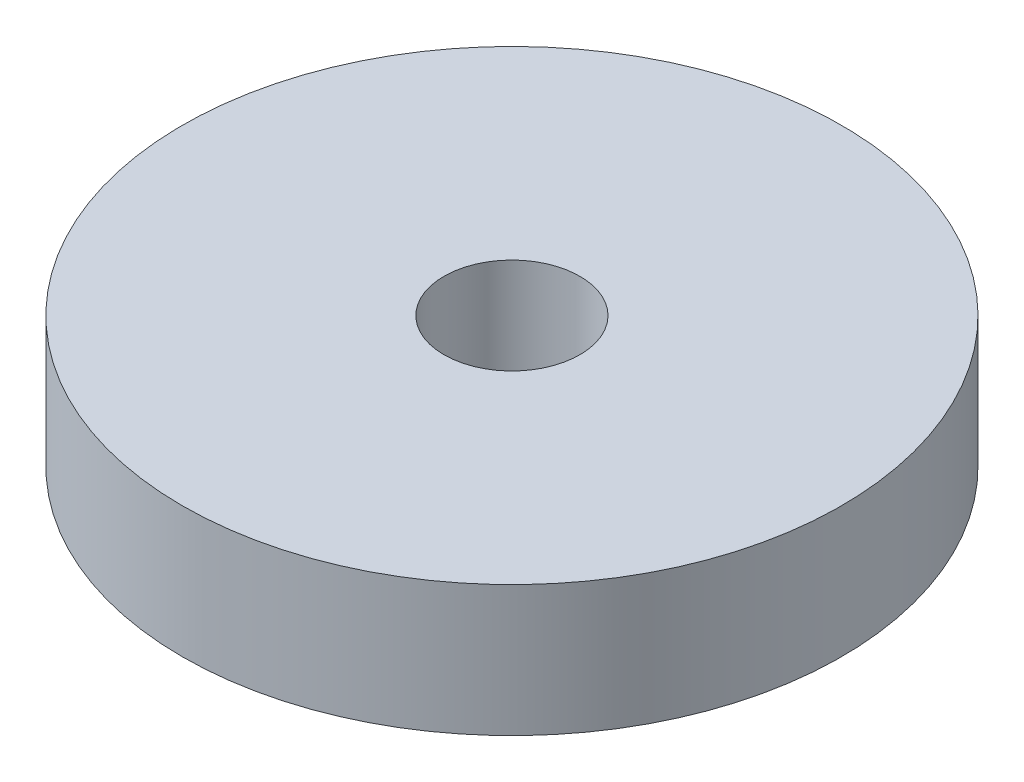
ISO-10303-21;
HEADER;
FILE_DESCRIPTION(('STEP AP214'),'2;1');
FILE_NAME('part.step','',(''),(''),'','','');
FILE_SCHEMA(('AUTOMOTIVE_DESIGN { 1 0 10303 214 1 1 1 1 }'));
ENDSEC;
DATA;
#1=APPLICATION_CONTEXT('core data for automotive mechanical design processes');
#2=APPLICATION_PROTOCOL_DEFINITION('international standard','automotive_design',2000,#1);
#3=PRODUCT_CONTEXT('',#1,'mechanical');
#4=PRODUCT('Part','Part','',(#3));
#5=PRODUCT_RELATED_PRODUCT_CATEGORY('part','',(#4));
#6=PRODUCT_DEFINITION_FORMATION('','',#4);
#7=PRODUCT_DEFINITION_CONTEXT('part definition',#1,'design');
#8=PRODUCT_DEFINITION('design','',#6,#7);
#9=PRODUCT_DEFINITION_SHAPE('','',#8);
#10=(LENGTH_UNIT() NAMED_UNIT(*) SI_UNIT(.MILLI.,.METRE.));
#11=(NAMED_UNIT(*) PLANE_ANGLE_UNIT() SI_UNIT($,.RADIAN.));
#12=(NAMED_UNIT(*) SI_UNIT($,.STERADIAN.) SOLID_ANGLE_UNIT());
#13=UNCERTAINTY_MEASURE_WITH_UNIT(LENGTH_MEASURE(1.E-05),#10,'distance_accuracy_value','');
#14=(GEOMETRIC_REPRESENTATION_CONTEXT(3) GLOBAL_UNCERTAINTY_ASSIGNED_CONTEXT((#13)) GLOBAL_UNIT_ASSIGNED_CONTEXT((#10,
#11,#12)) REPRESENTATION_CONTEXT('',''));
#15=CARTESIAN_POINT('',(0.,0.,0.));
#16=DIRECTION('',(0.,0.,1.));
#17=DIRECTION('',(1.,0.,0.));
#18=AXIS2_PLACEMENT_3D('',#15,#16,#17);
#19=CARTESIAN_POINT('',(0.,3.175,0.));
#20=DIRECTION('',(0.,1.,0.));
#21=DIRECTION('',(0.,0.,1.));
#22=AXIS2_PLACEMENT_3D('',#19,#20,#21);
#23=PLANE('',#22);
#24=CARTESIAN_POINT('',(0.,3.175,0.));
#25=DIRECTION('',(0.,1.,0.));
#26=DIRECTION('',(0.,0.,1.));
#27=AXIS2_PLACEMENT_3D('',#24,#25,#26);
#28=CIRCLE('',#27,8.);
#29=CARTESIAN_POINT('',(0.,3.175,8.));
#30=VERTEX_POINT('',#29);
#31=EDGE_CURVE('E10',#30,#30,#28,.T.);
#32=ORIENTED_EDGE('',*,*,#31,.T.);
#33=EDGE_LOOP('',(#32));
#34=FACE_BOUND('',#33,.T.);
#35=CARTESIAN_POINT('',(0.,3.175,0.));
#36=DIRECTION('',(0.,1.,0.));
#37=DIRECTION('',(0.,0.,1.));
#38=AXIS2_PLACEMENT_3D('',#35,#36,#37);
#39=CIRCLE('',#38,1.65);
#40=CARTESIAN_POINT('',(0.,3.175,1.65));
#41=VERTEX_POINT('',#40);
#42=EDGE_CURVE('E50',#41,#41,#39,.T.);
#43=ORIENTED_EDGE('',*,*,#42,.F.);
#44=EDGE_LOOP('',(#43));
#45=FACE_BOUND('',#44,.T.);
#46=ADVANCED_FACE('F39',(#34,#45),#23,.T.);
#47=CARTESIAN_POINT('',(0.,0.,0.));
#48=DIRECTION('',(0.,1.,0.));
#49=DIRECTION('',(0.,0.,1.));
#50=AXIS2_PLACEMENT_3D('',#47,#48,#49);
#51=PLANE('',#50);
#52=CARTESIAN_POINT('',(0.,0.,0.));
#53=DIRECTION('',(0.,1.,0.));
#54=DIRECTION('',(0.,0.,1.));
#55=AXIS2_PLACEMENT_3D('',#52,#53,#54);
#56=CIRCLE('',#55,8.);
#57=CARTESIAN_POINT('',(0.,0.,8.));
#58=VERTEX_POINT('',#57);
#59=EDGE_CURVE('E43',#58,#58,#56,.T.);
#60=ORIENTED_EDGE('',*,*,#59,.F.);
#61=EDGE_LOOP('',(#60));
#62=FACE_BOUND('',#61,.T.);
#63=CARTESIAN_POINT('',(0.,0.,0.));
#64=DIRECTION('',(0.,1.,0.));
#65=DIRECTION('',(0.,0.,1.));
#66=AXIS2_PLACEMENT_3D('',#63,#64,#65);
#67=CIRCLE('',#66,1.65);
#68=CARTESIAN_POINT('',(0.,0.,1.65));
#69=VERTEX_POINT('',#68);
#70=EDGE_CURVE('E52',#69,#69,#67,.T.);
#71=ORIENTED_EDGE('',*,*,#70,.T.);
#72=EDGE_LOOP('',(#71));
#73=FACE_BOUND('',#72,.T.);
#74=ADVANCED_FACE('F62',(#62,#73),#51,.F.);
#75=CARTESIAN_POINT('',(0.,3.175,0.));
#76=DIRECTION('',(0.,-1.,0.));
#77=DIRECTION('',(0.,0.,-1.));
#78=AXIS2_PLACEMENT_3D('',#75,#76,#77);
#79=CYLINDRICAL_SURFACE('',#78,8.);
#80=ORIENTED_EDGE('',*,*,#31,.F.);
#81=EDGE_LOOP('',(#80));
#82=FACE_BOUND('',#81,.T.);
#83=ORIENTED_EDGE('',*,*,#59,.T.);
#84=EDGE_LOOP('',(#83));
#85=FACE_BOUND('',#84,.T.);
#86=ADVANCED_FACE('F41',(#82,#85),#79,.T.);
#87=CARTESIAN_POINT('',(0.,3.175,0.));
#88=DIRECTION('',(0.,-1.,0.));
#89=DIRECTION('',(0.,0.,-1.));
#90=AXIS2_PLACEMENT_3D('',#87,#88,#89);
#91=CYLINDRICAL_SURFACE('',#90,1.65);
#92=ORIENTED_EDGE('',*,*,#42,.T.);
#93=EDGE_LOOP('',(#92));
#94=FACE_BOUND('',#93,.T.);
#95=ORIENTED_EDGE('',*,*,#70,.F.);
#96=EDGE_LOOP('',(#95));
#97=FACE_BOUND('',#96,.T.);
#98=ADVANCED_FACE('F58',(#94,#97),#91,.F.);
#99=CLOSED_SHELL('',(#46,#74,#86,#98));
#100=MANIFOLD_SOLID_BREP('B2',#99);
#101=ADVANCED_BREP_SHAPE_REPRESENTATION('',(#18,#100),#14);
#102=SHAPE_DEFINITION_REPRESENTATION(#9,#101);
ENDSEC;
END-ISO-10303-21;
